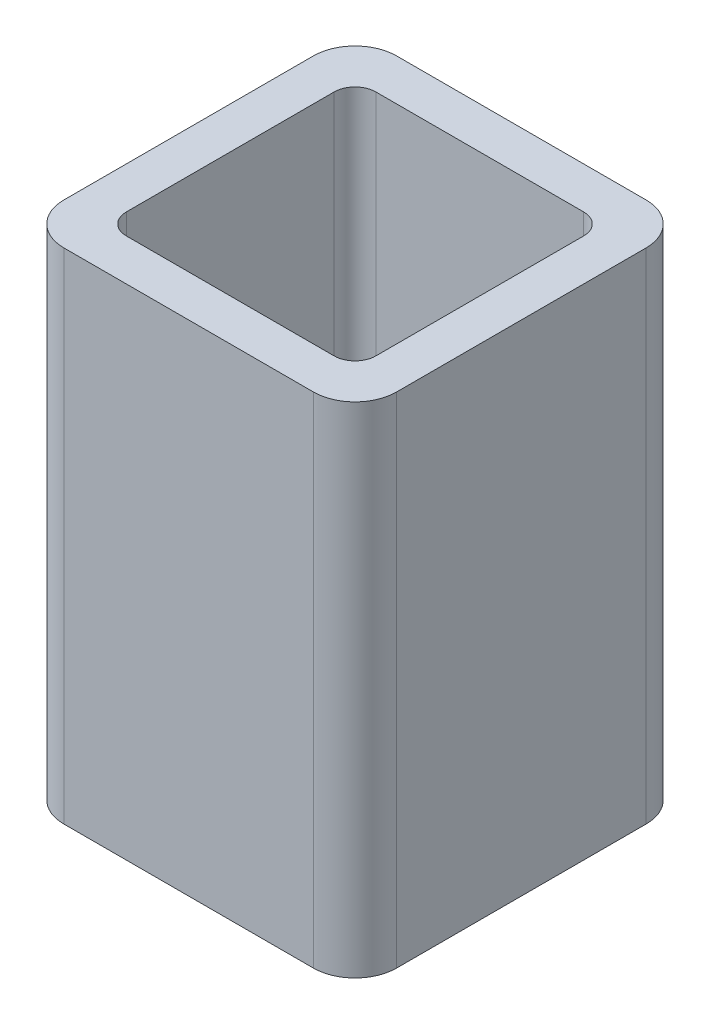
ISO-10303-21;
HEADER;
FILE_DESCRIPTION(('STEP AP214'),'2;1');
FILE_NAME('part.step','',(''),(''),'','','');
FILE_SCHEMA(('AUTOMOTIVE_DESIGN { 1 0 10303 214 1 1 1 1 }'));
ENDSEC;
DATA;
#1=APPLICATION_CONTEXT('core data for automotive mechanical design processes');
#2=APPLICATION_PROTOCOL_DEFINITION('international standard','automotive_design',2000,#1);
#3=PRODUCT_CONTEXT('',#1,'mechanical');
#4=PRODUCT('Part','Part','',(#3));
#5=PRODUCT_RELATED_PRODUCT_CATEGORY('part','',(#4));
#6=PRODUCT_DEFINITION_FORMATION('','',#4);
#7=PRODUCT_DEFINITION_CONTEXT('part definition',#1,'design');
#8=PRODUCT_DEFINITION('design','',#6,#7);
#9=PRODUCT_DEFINITION_SHAPE('','',#8);
#10=(LENGTH_UNIT() NAMED_UNIT(*) SI_UNIT(.MILLI.,.METRE.));
#11=(NAMED_UNIT(*) PLANE_ANGLE_UNIT() SI_UNIT($,.RADIAN.));
#12=(NAMED_UNIT(*) SI_UNIT($,.STERADIAN.) SOLID_ANGLE_UNIT());
#13=UNCERTAINTY_MEASURE_WITH_UNIT(LENGTH_MEASURE(1.E-05),#10,'distance_accuracy_value','');
#14=(GEOMETRIC_REPRESENTATION_CONTEXT(3) GLOBAL_UNCERTAINTY_ASSIGNED_CONTEXT((#13)) GLOBAL_UNIT_ASSIGNED_CONTEXT((#10,
#11,#12)) REPRESENTATION_CONTEXT('',''));
#15=CARTESIAN_POINT('',(0.,0.,0.));
#16=DIRECTION('',(0.,0.,1.));
#17=DIRECTION('',(1.,0.,0.));
#18=AXIS2_PLACEMENT_3D('',#15,#16,#17);
#19=CARTESIAN_POINT('',(30.,60.,30.));
#20=DIRECTION('',(0.,1.,0.));
#21=DIRECTION('',(0.,0.,1.));
#22=AXIS2_PLACEMENT_3D('',#19,#20,#21);
#23=PLANE('',#22);
#24=CARTESIAN_POINT('',(30.,60.,30.));
#25=DIRECTION('',(0.,1.,0.));
#26=DIRECTION('',(0.,0.,1.));
#27=AXIS2_PLACEMENT_3D('',#24,#25,#26);
#28=CIRCLE('',#27,10.);
#29=CARTESIAN_POINT('',(29.9999999999999,60.,40.));
#30=VERTEX_POINT('',#29);
#31=CARTESIAN_POINT('',(40.,60.,29.9999999999999));
#32=VERTEX_POINT('',#31);
#33=EDGE_CURVE('E211',#30,#32,#28,.T.);
#34=ORIENTED_EDGE('',*,*,#33,.T.);
#35=DIRECTION('',(0.,0.,-1.));
#36=VECTOR('',#35,1.);
#37=CARTESIAN_POINT('',(40.,60.,29.9999999999999));
#38=LINE('',#37,#36);
#39=CARTESIAN_POINT('',(40.,60.,-29.9999999999999));
#40=VERTEX_POINT('',#39);
#41=EDGE_CURVE('E214',#32,#40,#38,.T.);
#42=ORIENTED_EDGE('',*,*,#41,.T.);
#43=CARTESIAN_POINT('',(30.,60.,-30.));
#44=DIRECTION('',(0.,1.,0.));
#45=DIRECTION('',(0.,0.,-1.));
#46=AXIS2_PLACEMENT_3D('',#43,#44,#45);
#47=CIRCLE('',#46,10.);
#48=CARTESIAN_POINT('',(29.9999999999999,60.,-40.));
#49=VERTEX_POINT('',#48);
#50=EDGE_CURVE('E217',#40,#49,#47,.T.);
#51=ORIENTED_EDGE('',*,*,#50,.T.);
#52=DIRECTION('',(-1.,0.,0.));
#53=VECTOR('',#52,1.);
#54=CARTESIAN_POINT('',(-29.9999999999999,60.,-40.));
#55=LINE('',#54,#53);
#56=CARTESIAN_POINT('',(-29.9999999999999,60.,-40.));
#57=VERTEX_POINT('',#56);
#58=EDGE_CURVE('E219',#49,#57,#55,.T.);
#59=ORIENTED_EDGE('',*,*,#58,.T.);
#60=CARTESIAN_POINT('',(-30.,60.,-30.));
#61=DIRECTION('',(0.,1.,0.));
#62=DIRECTION('',(0.,0.,-1.));
#63=AXIS2_PLACEMENT_3D('',#60,#61,#62);
#64=CIRCLE('',#63,10.);
#65=CARTESIAN_POINT('',(-40.,60.,-29.9999999999999));
#66=VERTEX_POINT('',#65);
#67=EDGE_CURVE('E221',#57,#66,#64,.T.);
#68=ORIENTED_EDGE('',*,*,#67,.T.);
#69=DIRECTION('',(0.,0.,1.));
#70=VECTOR('',#69,1.);
#71=CARTESIAN_POINT('',(-40.,60.,29.9999999999999));
#72=LINE('',#71,#70);
#73=CARTESIAN_POINT('',(-40.,60.,29.9999999999999));
#74=VERTEX_POINT('',#73);
#75=EDGE_CURVE('E223',#66,#74,#72,.T.);
#76=ORIENTED_EDGE('',*,*,#75,.T.);
#77=CARTESIAN_POINT('',(-30.,60.,30.));
#78=DIRECTION('',(0.,1.,0.));
#79=DIRECTION('',(0.,0.,-1.));
#80=AXIS2_PLACEMENT_3D('',#77,#78,#79);
#81=CIRCLE('',#80,10.);
#82=CARTESIAN_POINT('',(-29.9999999999999,60.,40.));
#83=VERTEX_POINT('',#82);
#84=EDGE_CURVE('E225',#74,#83,#81,.T.);
#85=ORIENTED_EDGE('',*,*,#84,.T.);
#86=DIRECTION('',(1.,0.,0.));
#87=VECTOR('',#86,1.);
#88=CARTESIAN_POINT('',(-29.9999999999999,60.,40.));
#89=LINE('',#88,#87);
#90=EDGE_CURVE('E227',#83,#30,#89,.T.);
#91=ORIENTED_EDGE('',*,*,#90,.T.);
#92=EDGE_LOOP('',(#34,#42,#51,#59,#68,#76,#85,#91));
#93=FACE_BOUND('',#92,.T.);
#94=DIRECTION('',(1.,0.,0.));
#95=VECTOR('',#94,1.);
#96=CARTESIAN_POINT('',(-24.9999999999999,60.,30.));
#97=LINE('',#96,#95);
#98=CARTESIAN_POINT('',(-24.9999999999999,60.,30.));
#99=VERTEX_POINT('',#98);
#100=CARTESIAN_POINT('',(25.,60.,29.9999999999999));
#101=VERTEX_POINT('',#100);
#102=EDGE_CURVE('E154',#99,#101,#97,.T.);
#103=ORIENTED_EDGE('',*,*,#102,.F.);
#104=CARTESIAN_POINT('',(-24.9999999999999,60.,25.));
#105=DIRECTION('',(0.,1.,0.));
#106=DIRECTION('',(0.,0.,-1.));
#107=AXIS2_PLACEMENT_3D('',#104,#105,#106);
#108=CIRCLE('',#107,5.);
#109=CARTESIAN_POINT('',(-29.9999999999999,60.,25.));
#110=VERTEX_POINT('',#109);
#111=EDGE_CURVE('E146',#110,#99,#108,.T.);
#112=ORIENTED_EDGE('',*,*,#111,.F.);
#113=DIRECTION('',(0.,0.,1.));
#114=VECTOR('',#113,1.);
#115=CARTESIAN_POINT('',(-29.9999999999999,60.,25.));
#116=LINE('',#115,#114);
#117=CARTESIAN_POINT('',(-30.,60.,-25.));
#118=VERTEX_POINT('',#117);
#119=EDGE_CURVE('E179',#118,#110,#116,.T.);
#120=ORIENTED_EDGE('',*,*,#119,.F.);
#121=CARTESIAN_POINT('',(-25.,60.,-25.));
#122=DIRECTION('',(0.,1.,0.));
#123=DIRECTION('',(0.,0.,1.));
#124=AXIS2_PLACEMENT_3D('',#121,#122,#123);
#125=CIRCLE('',#124,5.);
#126=CARTESIAN_POINT('',(-25.,60.,-30.));
#127=VERTEX_POINT('',#126);
#128=EDGE_CURVE('E177',#127,#118,#125,.T.);
#129=ORIENTED_EDGE('',*,*,#128,.F.);
#130=DIRECTION('',(-1.,0.,0.));
#131=VECTOR('',#130,1.);
#132=CARTESIAN_POINT('',(-25.,60.,-30.));
#133=LINE('',#132,#131);
#134=CARTESIAN_POINT('',(24.9999999999999,60.,-30.));
#135=VERTEX_POINT('',#134);
#136=EDGE_CURVE('E175',#135,#127,#133,.T.);
#137=ORIENTED_EDGE('',*,*,#136,.F.);
#138=CARTESIAN_POINT('',(24.9999999999999,60.,-25.));
#139=DIRECTION('',(0.,1.,0.));
#140=DIRECTION('',(0.,0.,-1.));
#141=AXIS2_PLACEMENT_3D('',#138,#139,#140);
#142=CIRCLE('',#141,5.);
#143=CARTESIAN_POINT('',(29.9999999999999,60.,-25.));
#144=VERTEX_POINT('',#143);
#145=EDGE_CURVE('E173',#144,#135,#142,.T.);
#146=ORIENTED_EDGE('',*,*,#145,.F.);
#147=DIRECTION('',(0.,0.,-1.));
#148=VECTOR('',#147,1.);
#149=CARTESIAN_POINT('',(30.,60.,24.9999999999999));
#150=LINE('',#149,#148);
#151=CARTESIAN_POINT('',(30.,60.,24.9999999999999));
#152=VERTEX_POINT('',#151);
#153=EDGE_CURVE('E169',#152,#144,#150,.T.);
#154=ORIENTED_EDGE('',*,*,#153,.F.);
#155=CARTESIAN_POINT('',(25.,60.,24.9999999999999));
#156=DIRECTION('',(0.,1.,0.));
#157=DIRECTION('',(0.,0.,-1.));
#158=AXIS2_PLACEMENT_3D('',#155,#156,#157);
#159=CIRCLE('',#158,5.);
#160=EDGE_CURVE('E167',#101,#152,#159,.T.);
#161=ORIENTED_EDGE('',*,*,#160,.F.);
#162=EDGE_LOOP('',(#103,#112,#120,#129,#137,#146,#154,#161));
#163=FACE_BOUND('',#162,.T.);
#164=ADVANCED_FACE('F33',(#93,#163),#23,.T.);
#165=CARTESIAN_POINT('',(30.,-60.,30.));
#166=DIRECTION('',(0.,1.,0.));
#167=DIRECTION('',(0.,0.,1.));
#168=AXIS2_PLACEMENT_3D('',#165,#166,#167);
#169=PLANE('',#168);
#170=CARTESIAN_POINT('',(30.,-60.,30.));
#171=DIRECTION('',(0.,1.,0.));
#172=DIRECTION('',(0.,0.,1.));
#173=AXIS2_PLACEMENT_3D('',#170,#171,#172);
#174=CIRCLE('',#173,10.);
#175=CARTESIAN_POINT('',(29.9999999999999,-60.,40.));
#176=VERTEX_POINT('',#175);
#177=CARTESIAN_POINT('',(40.,-60.,29.9999999999999));
#178=VERTEX_POINT('',#177);
#179=EDGE_CURVE('E162',#176,#178,#174,.T.);
#180=ORIENTED_EDGE('',*,*,#179,.F.);
#181=DIRECTION('',(1.,0.,0.));
#182=VECTOR('',#181,1.);
#183=CARTESIAN_POINT('',(-29.9999999999999,-60.,40.));
#184=LINE('',#183,#182);
#185=CARTESIAN_POINT('',(-29.9999999999999,-60.,40.));
#186=VERTEX_POINT('',#185);
#187=EDGE_CURVE('E215',#186,#176,#184,.T.);
#188=ORIENTED_EDGE('',*,*,#187,.F.);
#189=CARTESIAN_POINT('',(-30.,-60.,30.));
#190=DIRECTION('',(0.,1.,0.));
#191=DIRECTION('',(0.,0.,-1.));
#192=AXIS2_PLACEMENT_3D('',#189,#190,#191);
#193=CIRCLE('',#192,10.);
#194=CARTESIAN_POINT('',(-40.,-60.,29.9999999999999));
#195=VERTEX_POINT('',#194);
#196=EDGE_CURVE('E242',#195,#186,#193,.T.);
#197=ORIENTED_EDGE('',*,*,#196,.F.);
#198=DIRECTION('',(0.,0.,1.));
#199=VECTOR('',#198,1.);
#200=CARTESIAN_POINT('',(-40.,-60.,29.9999999999999));
#201=LINE('',#200,#199);
#202=CARTESIAN_POINT('',(-40.,-60.,-29.9999999999999));
#203=VERTEX_POINT('',#202);
#204=EDGE_CURVE('E240',#203,#195,#201,.T.);
#205=ORIENTED_EDGE('',*,*,#204,.F.);
#206=CARTESIAN_POINT('',(-30.,-60.,-30.));
#207=DIRECTION('',(0.,1.,0.));
#208=DIRECTION('',(0.,0.,-1.));
#209=AXIS2_PLACEMENT_3D('',#206,#207,#208);
#210=CIRCLE('',#209,10.);
#211=CARTESIAN_POINT('',(-29.9999999999999,-60.,-40.));
#212=VERTEX_POINT('',#211);
#213=EDGE_CURVE('E238',#212,#203,#210,.T.);
#214=ORIENTED_EDGE('',*,*,#213,.F.);
#215=DIRECTION('',(-1.,0.,0.));
#216=VECTOR('',#215,1.);
#217=CARTESIAN_POINT('',(-29.9999999999999,-60.,-40.));
#218=LINE('',#217,#216);
#219=CARTESIAN_POINT('',(29.9999999999999,-60.,-40.));
#220=VERTEX_POINT('',#219);
#221=EDGE_CURVE('E236',#220,#212,#218,.T.);
#222=ORIENTED_EDGE('',*,*,#221,.F.);
#223=CARTESIAN_POINT('',(30.,-60.,-30.));
#224=DIRECTION('',(0.,1.,0.));
#225=DIRECTION('',(0.,0.,-1.));
#226=AXIS2_PLACEMENT_3D('',#223,#224,#225);
#227=CIRCLE('',#226,10.);
#228=CARTESIAN_POINT('',(40.,-60.,-29.9999999999999));
#229=VERTEX_POINT('',#228);
#230=EDGE_CURVE('E234',#229,#220,#227,.T.);
#231=ORIENTED_EDGE('',*,*,#230,.F.);
#232=DIRECTION('',(0.,0.,-1.));
#233=VECTOR('',#232,1.);
#234=CARTESIAN_POINT('',(40.,-60.,29.9999999999999));
#235=LINE('',#234,#233);
#236=EDGE_CURVE('E232',#178,#229,#235,.T.);
#237=ORIENTED_EDGE('',*,*,#236,.F.);
#238=EDGE_LOOP('',(#180,#188,#197,#205,#214,#222,#231,#237));
#239=FACE_BOUND('',#238,.T.);
#240=CARTESIAN_POINT('',(-24.9999999999999,-60.,25.));
#241=DIRECTION('',(0.,1.,0.));
#242=DIRECTION('',(0.,0.,-1.));
#243=AXIS2_PLACEMENT_3D('',#240,#241,#242);
#244=CIRCLE('',#243,5.);
#245=CARTESIAN_POINT('',(-29.9999999999999,-60.,25.));
#246=VERTEX_POINT('',#245);
#247=CARTESIAN_POINT('',(-24.9999999999999,-60.,30.));
#248=VERTEX_POINT('',#247);
#249=EDGE_CURVE('E56',#246,#248,#244,.T.);
#250=ORIENTED_EDGE('',*,*,#249,.T.);
#251=DIRECTION('',(1.,0.,0.));
#252=VECTOR('',#251,1.);
#253=CARTESIAN_POINT('',(-24.9999999999999,-60.,30.));
#254=LINE('',#253,#252);
#255=CARTESIAN_POINT('',(25.,-60.,29.9999999999999));
#256=VERTEX_POINT('',#255);
#257=EDGE_CURVE('E161',#248,#256,#254,.T.);
#258=ORIENTED_EDGE('',*,*,#257,.T.);
#259=CARTESIAN_POINT('',(25.,-60.,24.9999999999999));
#260=DIRECTION('',(0.,1.,0.));
#261=DIRECTION('',(0.,0.,-1.));
#262=AXIS2_PLACEMENT_3D('',#259,#260,#261);
#263=CIRCLE('',#262,5.);
#264=CARTESIAN_POINT('',(30.,-60.,24.9999999999999));
#265=VERTEX_POINT('',#264);
#266=EDGE_CURVE('E183',#256,#265,#263,.T.);
#267=ORIENTED_EDGE('',*,*,#266,.T.);
#268=DIRECTION('',(0.,0.,-1.));
#269=VECTOR('',#268,1.);
#270=CARTESIAN_POINT('',(30.,-60.,24.9999999999999));
#271=LINE('',#270,#269);
#272=CARTESIAN_POINT('',(29.9999999999999,-60.,-25.));
#273=VERTEX_POINT('',#272);
#274=EDGE_CURVE('E186',#265,#273,#271,.T.);
#275=ORIENTED_EDGE('',*,*,#274,.T.);
#276=CARTESIAN_POINT('',(24.9999999999999,-60.,-25.));
#277=DIRECTION('',(0.,1.,0.));
#278=DIRECTION('',(0.,0.,-1.));
#279=AXIS2_PLACEMENT_3D('',#276,#277,#278);
#280=CIRCLE('',#279,5.);
#281=CARTESIAN_POINT('',(24.9999999999999,-60.,-30.));
#282=VERTEX_POINT('',#281);
#283=EDGE_CURVE('E189',#273,#282,#280,.T.);
#284=ORIENTED_EDGE('',*,*,#283,.T.);
#285=DIRECTION('',(-1.,0.,0.));
#286=VECTOR('',#285,1.);
#287=CARTESIAN_POINT('',(-25.,-60.,-30.));
#288=LINE('',#287,#286);
#289=CARTESIAN_POINT('',(-25.,-60.,-30.));
#290=VERTEX_POINT('',#289);
#291=EDGE_CURVE('E192',#282,#290,#288,.T.);
#292=ORIENTED_EDGE('',*,*,#291,.T.);
#293=CARTESIAN_POINT('',(-25.,-60.,-25.));
#294=DIRECTION('',(0.,1.,0.));
#295=DIRECTION('',(0.,0.,1.));
#296=AXIS2_PLACEMENT_3D('',#293,#294,#295);
#297=CIRCLE('',#296,5.);
#298=CARTESIAN_POINT('',(-30.,-60.,-25.));
#299=VERTEX_POINT('',#298);
#300=EDGE_CURVE('E195',#290,#299,#297,.T.);
#301=ORIENTED_EDGE('',*,*,#300,.T.);
#302=DIRECTION('',(0.,0.,1.));
#303=VECTOR('',#302,1.);
#304=CARTESIAN_POINT('',(-29.9999999999999,-60.,25.));
#305=LINE('',#304,#303);
#306=EDGE_CURVE('E155',#299,#246,#305,.T.);
#307=ORIENTED_EDGE('',*,*,#306,.T.);
#308=EDGE_LOOP('',(#250,#258,#267,#275,#284,#292,#301,#307));
#309=FACE_BOUND('',#308,.T.);
#310=ADVANCED_FACE('F272',(#239,#309),#169,.F.);
#311=CARTESIAN_POINT('',(30.,60.,30.));
#312=DIRECTION('',(0.,-1.,0.));
#313=DIRECTION('',(0.,0.,-1.));
#314=AXIS2_PLACEMENT_3D('',#311,#312,#313);
#315=CYLINDRICAL_SURFACE('',#314,10.);
#316=ORIENTED_EDGE('',*,*,#179,.T.);
#317=DIRECTION('',(0.,-1.,0.));
#318=VECTOR('',#317,1.);
#319=CARTESIAN_POINT('',(40.,60.,29.9999999999999));
#320=LINE('',#319,#318);
#321=EDGE_CURVE('E11',#32,#178,#320,.T.);
#322=ORIENTED_EDGE('',*,*,#321,.F.);
#323=ORIENTED_EDGE('',*,*,#33,.F.);
#324=DIRECTION('',(0.,-1.,0.));
#325=VECTOR('',#324,1.);
#326=CARTESIAN_POINT('',(29.9999999999999,60.,40.));
#327=LINE('',#326,#325);
#328=EDGE_CURVE('E229',#30,#176,#327,.T.);
#329=ORIENTED_EDGE('',*,*,#328,.T.);
#330=EDGE_LOOP('',(#316,#322,#323,#329));
#331=FACE_BOUND('',#330,.T.);
#332=ADVANCED_FACE('F35',(#331),#315,.T.);
#333=CARTESIAN_POINT('',(40.,60.,29.9999999999999));
#334=DIRECTION('',(-1.,0.,0.));
#335=DIRECTION('',(0.,0.,1.));
#336=AXIS2_PLACEMENT_3D('',#333,#334,#335);
#337=PLANE('',#336);
#338=ORIENTED_EDGE('',*,*,#236,.T.);
#339=DIRECTION('',(0.,-1.,0.));
#340=VECTOR('',#339,1.);
#341=CARTESIAN_POINT('',(40.,60.,-29.9999999999999));
#342=LINE('',#341,#340);
#343=EDGE_CURVE('E41',#40,#229,#342,.T.);
#344=ORIENTED_EDGE('',*,*,#343,.F.);
#345=ORIENTED_EDGE('',*,*,#41,.F.);
#346=ORIENTED_EDGE('',*,*,#321,.T.);
#347=EDGE_LOOP('',(#338,#344,#345,#346));
#348=FACE_BOUND('',#347,.T.);
#349=ADVANCED_FACE('F289',(#348),#337,.F.);
#350=CARTESIAN_POINT('',(30.,60.,-30.));
#351=DIRECTION('',(0.,-1.,0.));
#352=DIRECTION('',(0.,0.,-1.));
#353=AXIS2_PLACEMENT_3D('',#350,#351,#352);
#354=CYLINDRICAL_SURFACE('',#353,10.);
#355=ORIENTED_EDGE('',*,*,#230,.T.);
#356=DIRECTION('',(0.,-1.,0.));
#357=VECTOR('',#356,1.);
#358=CARTESIAN_POINT('',(29.9999999999999,60.,-40.));
#359=LINE('',#358,#357);
#360=EDGE_CURVE('E259',#49,#220,#359,.T.);
#361=ORIENTED_EDGE('',*,*,#360,.F.);
#362=ORIENTED_EDGE('',*,*,#50,.F.);
#363=ORIENTED_EDGE('',*,*,#343,.T.);
#364=EDGE_LOOP('',(#355,#361,#362,#363));
#365=FACE_BOUND('',#364,.T.);
#366=ADVANCED_FACE('F266',(#365),#354,.T.);
#367=CARTESIAN_POINT('',(-29.9999999999999,60.,-40.));
#368=DIRECTION('',(0.,0.,1.));
#369=DIRECTION('',(1.,0.,0.));
#370=AXIS2_PLACEMENT_3D('',#367,#368,#369);
#371=PLANE('',#370);
#372=ORIENTED_EDGE('',*,*,#221,.T.);
#373=DIRECTION('',(0.,-1.,0.));
#374=VECTOR('',#373,1.);
#375=CARTESIAN_POINT('',(-29.9999999999999,60.,-40.));
#376=LINE('',#375,#374);
#377=EDGE_CURVE('E256',#57,#212,#376,.T.);
#378=ORIENTED_EDGE('',*,*,#377,.F.);
#379=ORIENTED_EDGE('',*,*,#58,.F.);
#380=ORIENTED_EDGE('',*,*,#360,.T.);
#381=EDGE_LOOP('',(#372,#378,#379,#380));
#382=FACE_BOUND('',#381,.T.);
#383=ADVANCED_FACE('F278',(#382),#371,.F.);
#384=CARTESIAN_POINT('',(-30.,60.,-30.));
#385=DIRECTION('',(0.,-1.,0.));
#386=DIRECTION('',(0.,0.,-1.));
#387=AXIS2_PLACEMENT_3D('',#384,#385,#386);
#388=CYLINDRICAL_SURFACE('',#387,10.);
#389=ORIENTED_EDGE('',*,*,#213,.T.);
#390=DIRECTION('',(0.,-1.,0.));
#391=VECTOR('',#390,1.);
#392=CARTESIAN_POINT('',(-40.,60.,-29.9999999999999));
#393=LINE('',#392,#391);
#394=EDGE_CURVE('E253',#66,#203,#393,.T.);
#395=ORIENTED_EDGE('',*,*,#394,.F.);
#396=ORIENTED_EDGE('',*,*,#67,.F.);
#397=ORIENTED_EDGE('',*,*,#377,.T.);
#398=EDGE_LOOP('',(#389,#395,#396,#397));
#399=FACE_BOUND('',#398,.T.);
#400=ADVANCED_FACE('F282',(#399),#388,.T.);
#401=CARTESIAN_POINT('',(-40.,60.,29.9999999999999));
#402=DIRECTION('',(1.,0.,0.));
#403=DIRECTION('',(0.,0.,-1.));
#404=AXIS2_PLACEMENT_3D('',#401,#402,#403);
#405=PLANE('',#404);
#406=ORIENTED_EDGE('',*,*,#204,.T.);
#407=DIRECTION('',(0.,-1.,0.));
#408=VECTOR('',#407,1.);
#409=CARTESIAN_POINT('',(-40.,60.,29.9999999999999));
#410=LINE('',#409,#408);
#411=EDGE_CURVE('E250',#74,#195,#410,.T.);
#412=ORIENTED_EDGE('',*,*,#411,.F.);
#413=ORIENTED_EDGE('',*,*,#75,.F.);
#414=ORIENTED_EDGE('',*,*,#394,.T.);
#415=EDGE_LOOP('',(#406,#412,#413,#414));
#416=FACE_BOUND('',#415,.T.);
#417=ADVANCED_FACE('F302',(#416),#405,.F.);
#418=CARTESIAN_POINT('',(-30.,60.,30.));
#419=DIRECTION('',(0.,-1.,0.));
#420=DIRECTION('',(0.,0.,-1.));
#421=AXIS2_PLACEMENT_3D('',#418,#419,#420);
#422=CYLINDRICAL_SURFACE('',#421,10.);
#423=ORIENTED_EDGE('',*,*,#196,.T.);
#424=DIRECTION('',(0.,-1.,0.));
#425=VECTOR('',#424,1.);
#426=CARTESIAN_POINT('',(-29.9999999999999,60.,40.));
#427=LINE('',#426,#425);
#428=EDGE_CURVE('E247',#83,#186,#427,.T.);
#429=ORIENTED_EDGE('',*,*,#428,.F.);
#430=ORIENTED_EDGE('',*,*,#84,.F.);
#431=ORIENTED_EDGE('',*,*,#411,.T.);
#432=EDGE_LOOP('',(#423,#429,#430,#431));
#433=FACE_BOUND('',#432,.T.);
#434=ADVANCED_FACE('F300',(#433),#422,.T.);
#435=CARTESIAN_POINT('',(-29.9999999999999,60.,40.));
#436=DIRECTION('',(0.,0.,-1.));
#437=DIRECTION('',(-1.,0.,0.));
#438=AXIS2_PLACEMENT_3D('',#435,#436,#437);
#439=PLANE('',#438);
#440=ORIENTED_EDGE('',*,*,#187,.T.);
#441=ORIENTED_EDGE('',*,*,#328,.F.);
#442=ORIENTED_EDGE('',*,*,#90,.F.);
#443=ORIENTED_EDGE('',*,*,#428,.T.);
#444=EDGE_LOOP('',(#440,#441,#442,#443));
#445=FACE_BOUND('',#444,.T.);
#446=ADVANCED_FACE('F295',(#445),#439,.F.);
#447=CARTESIAN_POINT('',(-24.9999999999999,60.,25.));
#448=DIRECTION('',(0.,-1.,0.));
#449=DIRECTION('',(0.,0.,-1.));
#450=AXIS2_PLACEMENT_3D('',#447,#448,#449);
#451=CYLINDRICAL_SURFACE('',#450,5.);
#452=ORIENTED_EDGE('',*,*,#249,.F.);
#453=DIRECTION('',(0.,-1.,0.));
#454=VECTOR('',#453,1.);
#455=CARTESIAN_POINT('',(-29.9999999999999,60.,25.));
#456=LINE('',#455,#454);
#457=EDGE_CURVE('E150',#110,#246,#456,.T.);
#458=ORIENTED_EDGE('',*,*,#457,.F.);
#459=ORIENTED_EDGE('',*,*,#111,.T.);
#460=DIRECTION('',(0.,-1.,0.));
#461=VECTOR('',#460,1.);
#462=CARTESIAN_POINT('',(-24.9999999999999,60.,30.));
#463=LINE('',#462,#461);
#464=EDGE_CURVE('E149',#99,#248,#463,.T.);
#465=ORIENTED_EDGE('',*,*,#464,.T.);
#466=EDGE_LOOP('',(#452,#458,#459,#465));
#467=FACE_BOUND('',#466,.T.);
#468=ADVANCED_FACE('F148',(#467),#451,.F.);
#469=CARTESIAN_POINT('',(-24.9999999999999,60.,30.));
#470=DIRECTION('',(0.,0.,-1.));
#471=DIRECTION('',(-1.,0.,0.));
#472=AXIS2_PLACEMENT_3D('',#469,#470,#471);
#473=PLANE('',#472);
#474=ORIENTED_EDGE('',*,*,#257,.F.);
#475=ORIENTED_EDGE('',*,*,#464,.F.);
#476=ORIENTED_EDGE('',*,*,#102,.T.);
#477=DIRECTION('',(0.,-1.,0.));
#478=VECTOR('',#477,1.);
#479=CARTESIAN_POINT('',(25.,60.,29.9999999999999));
#480=LINE('',#479,#478);
#481=EDGE_CURVE('E163',#101,#256,#480,.T.);
#482=ORIENTED_EDGE('',*,*,#481,.T.);
#483=EDGE_LOOP('',(#474,#475,#476,#482));
#484=FACE_BOUND('',#483,.T.);
#485=ADVANCED_FACE('F158',(#484),#473,.T.);
#486=CARTESIAN_POINT('',(25.,60.,24.9999999999999));
#487=DIRECTION('',(0.,-1.,0.));
#488=DIRECTION('',(0.,0.,-1.));
#489=AXIS2_PLACEMENT_3D('',#486,#487,#488);
#490=CYLINDRICAL_SURFACE('',#489,5.);
#491=ORIENTED_EDGE('',*,*,#266,.F.);
#492=ORIENTED_EDGE('',*,*,#481,.F.);
#493=ORIENTED_EDGE('',*,*,#160,.T.);
#494=DIRECTION('',(0.,-1.,0.));
#495=VECTOR('',#494,1.);
#496=CARTESIAN_POINT('',(30.,60.,24.9999999999999));
#497=LINE('',#496,#495);
#498=EDGE_CURVE('E208',#152,#265,#497,.T.);
#499=ORIENTED_EDGE('',*,*,#498,.T.);
#500=EDGE_LOOP('',(#491,#492,#493,#499));
#501=FACE_BOUND('',#500,.T.);
#502=ADVANCED_FACE('F327',(#501),#490,.F.);
#503=CARTESIAN_POINT('',(30.,60.,24.9999999999999));
#504=DIRECTION('',(-1.,0.,0.));
#505=DIRECTION('',(0.,0.,1.));
#506=AXIS2_PLACEMENT_3D('',#503,#504,#505);
#507=PLANE('',#506);
#508=ORIENTED_EDGE('',*,*,#274,.F.);
#509=ORIENTED_EDGE('',*,*,#498,.F.);
#510=ORIENTED_EDGE('',*,*,#153,.T.);
#511=DIRECTION('',(0.,-1.,0.));
#512=VECTOR('',#511,1.);
#513=CARTESIAN_POINT('',(29.9999999999999,60.,-25.));
#514=LINE('',#513,#512);
#515=EDGE_CURVE('E206',#144,#273,#514,.T.);
#516=ORIENTED_EDGE('',*,*,#515,.T.);
#517=EDGE_LOOP('',(#508,#509,#510,#516));
#518=FACE_BOUND('',#517,.T.);
#519=ADVANCED_FACE('F331',(#518),#507,.T.);
#520=CARTESIAN_POINT('',(24.9999999999999,60.,-25.));
#521=DIRECTION('',(0.,-1.,0.));
#522=DIRECTION('',(0.,0.,-1.));
#523=AXIS2_PLACEMENT_3D('',#520,#521,#522);
#524=CYLINDRICAL_SURFACE('',#523,5.);
#525=ORIENTED_EDGE('',*,*,#283,.F.);
#526=ORIENTED_EDGE('',*,*,#515,.F.);
#527=ORIENTED_EDGE('',*,*,#145,.T.);
#528=DIRECTION('',(0.,-1.,0.));
#529=VECTOR('',#528,1.);
#530=CARTESIAN_POINT('',(24.9999999999999,60.,-30.));
#531=LINE('',#530,#529);
#532=EDGE_CURVE('E204',#135,#282,#531,.T.);
#533=ORIENTED_EDGE('',*,*,#532,.T.);
#534=EDGE_LOOP('',(#525,#526,#527,#533));
#535=FACE_BOUND('',#534,.T.);
#536=ADVANCED_FACE('F337',(#535),#524,.F.);
#537=CARTESIAN_POINT('',(-25.,60.,-30.));
#538=DIRECTION('',(0.,0.,1.));
#539=DIRECTION('',(1.,0.,0.));
#540=AXIS2_PLACEMENT_3D('',#537,#538,#539);
#541=PLANE('',#540);
#542=ORIENTED_EDGE('',*,*,#291,.F.);
#543=ORIENTED_EDGE('',*,*,#532,.F.);
#544=ORIENTED_EDGE('',*,*,#136,.T.);
#545=DIRECTION('',(0.,-1.,0.));
#546=VECTOR('',#545,1.);
#547=CARTESIAN_POINT('',(-25.,60.,-30.));
#548=LINE('',#547,#546);
#549=EDGE_CURVE('E202',#127,#290,#548,.T.);
#550=ORIENTED_EDGE('',*,*,#549,.T.);
#551=EDGE_LOOP('',(#542,#543,#544,#550));
#552=FACE_BOUND('',#551,.T.);
#553=ADVANCED_FACE('F341',(#552),#541,.T.);
#554=CARTESIAN_POINT('',(-25.,60.,-25.));
#555=DIRECTION('',(0.,-1.,0.));
#556=DIRECTION('',(0.,0.,-1.));
#557=AXIS2_PLACEMENT_3D('',#554,#555,#556);
#558=CYLINDRICAL_SURFACE('',#557,5.);
#559=ORIENTED_EDGE('',*,*,#300,.F.);
#560=ORIENTED_EDGE('',*,*,#549,.F.);
#561=ORIENTED_EDGE('',*,*,#128,.T.);
#562=DIRECTION('',(0.,-1.,0.));
#563=VECTOR('',#562,1.);
#564=CARTESIAN_POINT('',(-30.,60.,-25.));
#565=LINE('',#564,#563);
#566=EDGE_CURVE('E48',#118,#299,#565,.T.);
#567=ORIENTED_EDGE('',*,*,#566,.T.);
#568=EDGE_LOOP('',(#559,#560,#561,#567));
#569=FACE_BOUND('',#568,.T.);
#570=ADVANCED_FACE('F345',(#569),#558,.F.);
#571=CARTESIAN_POINT('',(-29.9999999999999,60.,25.));
#572=DIRECTION('',(1.,0.,0.));
#573=DIRECTION('',(0.,0.,-1.));
#574=AXIS2_PLACEMENT_3D('',#571,#572,#573);
#575=PLANE('',#574);
#576=ORIENTED_EDGE('',*,*,#306,.F.);
#577=ORIENTED_EDGE('',*,*,#566,.F.);
#578=ORIENTED_EDGE('',*,*,#119,.T.);
#579=ORIENTED_EDGE('',*,*,#457,.T.);
#580=EDGE_LOOP('',(#576,#577,#578,#579));
#581=FACE_BOUND('',#580,.T.);
#582=ADVANCED_FACE('F349',(#581),#575,.T.);
#583=CLOSED_SHELL('',(#164,#310,#332,#349,#366,#383,#400,#417,#434,#446,#468,#485,#502,#519,
#536,#553,#570,#582));
#584=MANIFOLD_SOLID_BREP('B2',#583);
#585=ADVANCED_BREP_SHAPE_REPRESENTATION('',(#18,#584),#14);
#586=SHAPE_DEFINITION_REPRESENTATION(#9,#585);
ENDSEC;
END-ISO-10303-21;
